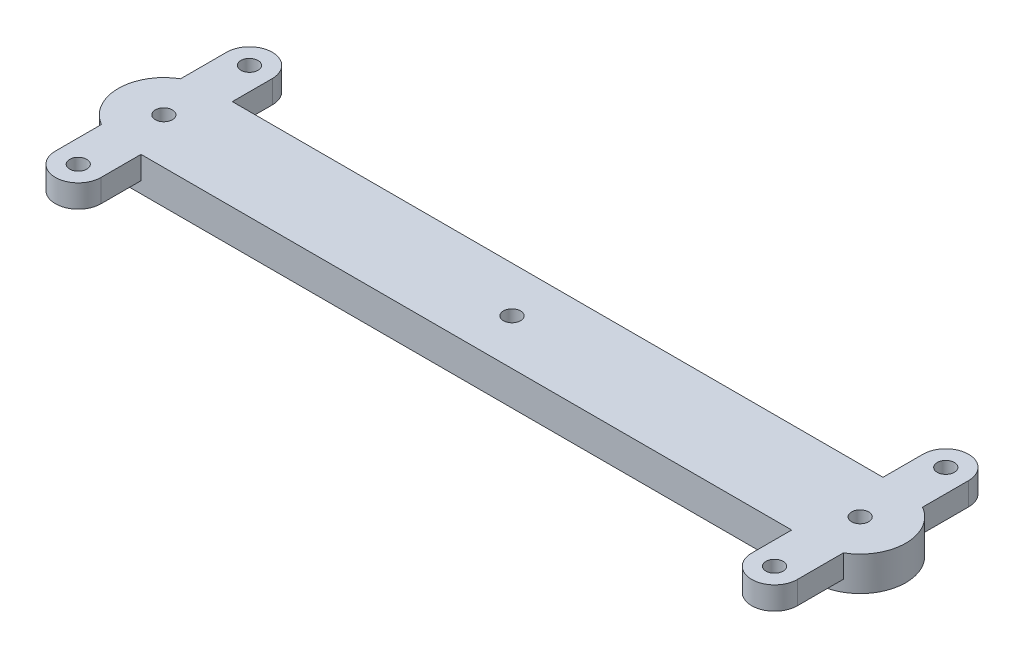
ISO-10303-21;
HEADER;
FILE_DESCRIPTION(('STEP AP214'),'2;1');
FILE_NAME('part.step','',(''),(''),'','','');
FILE_SCHEMA(('AUTOMOTIVE_DESIGN { 1 0 10303 214 1 1 1 1 }'));
ENDSEC;
DATA;
#1=APPLICATION_CONTEXT('core data for automotive mechanical design processes');
#2=APPLICATION_PROTOCOL_DEFINITION('international standard','automotive_design',2000,#1);
#3=PRODUCT_CONTEXT('',#1,'mechanical');
#4=PRODUCT('Part','Part','',(#3));
#5=PRODUCT_RELATED_PRODUCT_CATEGORY('part','',(#4));
#6=PRODUCT_DEFINITION_FORMATION('','',#4);
#7=PRODUCT_DEFINITION_CONTEXT('part definition',#1,'design');
#8=PRODUCT_DEFINITION('design','',#6,#7);
#9=PRODUCT_DEFINITION_SHAPE('','',#8);
#10=(LENGTH_UNIT() NAMED_UNIT(*) SI_UNIT(.MILLI.,.METRE.));
#11=(NAMED_UNIT(*) PLANE_ANGLE_UNIT() SI_UNIT($,.RADIAN.));
#12=(NAMED_UNIT(*) SI_UNIT($,.STERADIAN.) SOLID_ANGLE_UNIT());
#13=UNCERTAINTY_MEASURE_WITH_UNIT(LENGTH_MEASURE(1.E-05),#10,'distance_accuracy_value','');
#14=(GEOMETRIC_REPRESENTATION_CONTEXT(3) GLOBAL_UNCERTAINTY_ASSIGNED_CONTEXT((#13)) GLOBAL_UNIT_ASSIGNED_CONTEXT((#10,
#11,#12)) REPRESENTATION_CONTEXT('',''));
#15=CARTESIAN_POINT('',(0.,0.,0.));
#16=DIRECTION('',(0.,0.,1.));
#17=DIRECTION('',(1.,0.,0.));
#18=AXIS2_PLACEMENT_3D('',#15,#16,#17);
#19=CARTESIAN_POINT('',(0.,6.,8.));
#20=DIRECTION('',(0.,0.,-1.));
#21=DIRECTION('',(-1.,0.,0.));
#22=AXIS2_PLACEMENT_3D('',#19,#20,#21);
#23=PLANE('',#22);
#24=DIRECTION('',(0.,1.,0.));
#25=VECTOR('',#24,1.);
#26=CARTESIAN_POINT('',(4.,6.,8.));
#27=LINE('',#26,#25);
#28=CARTESIAN_POINT('',(4.,2.,8.));
#29=VERTEX_POINT('',#28);
#30=CARTESIAN_POINT('',(4.,6.,8.));
#31=VERTEX_POINT('',#30);
#32=EDGE_CURVE('E334',#29,#31,#27,.T.);
#33=ORIENTED_EDGE('',*,*,#32,.F.);
#34=DIRECTION('',(1.,0.,0.));
#35=VECTOR('',#34,1.);
#36=CARTESIAN_POINT('',(0.,2.,8.));
#37=LINE('',#36,#35);
#38=CARTESIAN_POINT('',(0.,2.,8.));
#39=VERTEX_POINT('',#38);
#40=EDGE_CURVE('E330',#39,#29,#37,.T.);
#41=ORIENTED_EDGE('',*,*,#40,.F.);
#42=DIRECTION('',(0.,-1.,0.));
#43=VECTOR('',#42,1.);
#44=CARTESIAN_POINT('',(0.,6.,8.));
#45=LINE('',#44,#43);
#46=CARTESIAN_POINT('',(0.,0.,8.));
#47=VERTEX_POINT('',#46);
#48=EDGE_CURVE('E492',#39,#47,#45,.T.);
#49=ORIENTED_EDGE('',*,*,#48,.T.);
#50=DIRECTION('',(1.,0.,0.));
#51=VECTOR('',#50,1.);
#52=CARTESIAN_POINT('',(0.,0.,8.));
#53=LINE('',#52,#51);
#54=CARTESIAN_POINT('',(122.,0.,8.));
#55=VERTEX_POINT('',#54);
#56=EDGE_CURVE('E473',#47,#55,#53,.T.);
#57=ORIENTED_EDGE('',*,*,#56,.T.);
#58=DIRECTION('',(0.,-1.,0.));
#59=VECTOR('',#58,1.);
#60=CARTESIAN_POINT('',(122.,6.,8.));
#61=LINE('',#60,#59);
#62=CARTESIAN_POINT('',(122.,2.,8.));
#63=VERTEX_POINT('',#62);
#64=EDGE_CURVE('E489',#63,#55,#61,.T.);
#65=ORIENTED_EDGE('',*,*,#64,.F.);
#66=DIRECTION('',(1.,0.,0.));
#67=VECTOR('',#66,1.);
#68=CARTESIAN_POINT('',(0.,2.,8.));
#69=LINE('',#68,#67);
#70=CARTESIAN_POINT('',(118.,2.,8.));
#71=VERTEX_POINT('',#70);
#72=EDGE_CURVE('E373',#71,#63,#69,.T.);
#73=ORIENTED_EDGE('',*,*,#72,.F.);
#74=DIRECTION('',(0.,1.,0.));
#75=VECTOR('',#74,1.);
#76=CARTESIAN_POINT('',(118.,2.,8.));
#77=LINE('',#76,#75);
#78=CARTESIAN_POINT('',(118.,6.,8.));
#79=VERTEX_POINT('',#78);
#80=EDGE_CURVE('E347',#71,#79,#77,.T.);
#81=ORIENTED_EDGE('',*,*,#80,.T.);
#82=DIRECTION('',(1.,0.,0.));
#83=VECTOR('',#82,1.);
#84=CARTESIAN_POINT('',(0.,6.,8.));
#85=LINE('',#84,#83);
#86=EDGE_CURVE('E460',#31,#79,#85,.T.);
#87=ORIENTED_EDGE('',*,*,#86,.F.);
#88=EDGE_LOOP('',(#33,#41,#49,#57,#65,#73,#81,#87));
#89=FACE_BOUND('',#88,.T.);
#90=ADVANCED_FACE('F119',(#89),#23,.F.);
#91=CARTESIAN_POINT('',(0.,6.,-8.));
#92=DIRECTION('',(0.,0.,-1.));
#93=DIRECTION('',(-1.,0.,0.));
#94=AXIS2_PLACEMENT_3D('',#91,#92,#93);
#95=PLANE('',#94);
#96=DIRECTION('',(1.,0.,0.));
#97=VECTOR('',#96,1.);
#98=CARTESIAN_POINT('',(0.,2.,-8.));
#99=LINE('',#98,#97);
#100=CARTESIAN_POINT('',(0.,2.,-8.));
#101=VERTEX_POINT('',#100);
#102=CARTESIAN_POINT('',(4.,2.,-8.));
#103=VERTEX_POINT('',#102);
#104=EDGE_CURVE('E321',#101,#103,#99,.T.);
#105=ORIENTED_EDGE('',*,*,#104,.T.);
#106=DIRECTION('',(0.,1.,0.));
#107=VECTOR('',#106,1.);
#108=CARTESIAN_POINT('',(4.,6.,-8.));
#109=LINE('',#108,#107);
#110=CARTESIAN_POINT('',(4.,6.,-8.));
#111=VERTEX_POINT('',#110);
#112=EDGE_CURVE('E495',#103,#111,#109,.T.);
#113=ORIENTED_EDGE('',*,*,#112,.T.);
#114=DIRECTION('',(1.,0.,0.));
#115=VECTOR('',#114,1.);
#116=CARTESIAN_POINT('',(0.,6.,-8.));
#117=LINE('',#116,#115);
#118=CARTESIAN_POINT('',(118.,6.,-8.));
#119=VERTEX_POINT('',#118);
#120=EDGE_CURVE('E276',#111,#119,#117,.T.);
#121=ORIENTED_EDGE('',*,*,#120,.T.);
#122=DIRECTION('',(0.,1.,0.));
#123=VECTOR('',#122,1.);
#124=CARTESIAN_POINT('',(118.,2.,-8.));
#125=LINE('',#124,#123);
#126=CARTESIAN_POINT('',(118.,2.,-8.));
#127=VERTEX_POINT('',#126);
#128=EDGE_CURVE('E436',#127,#119,#125,.T.);
#129=ORIENTED_EDGE('',*,*,#128,.F.);
#130=DIRECTION('',(-1.,0.,0.));
#131=VECTOR('',#130,1.);
#132=CARTESIAN_POINT('',(0.,2.,-8.));
#133=LINE('',#132,#131);
#134=CARTESIAN_POINT('',(122.,2.,-8.));
#135=VERTEX_POINT('',#134);
#136=EDGE_CURVE('E401',#135,#127,#133,.T.);
#137=ORIENTED_EDGE('',*,*,#136,.F.);
#138=DIRECTION('',(0.,-1.,0.));
#139=VECTOR('',#138,1.);
#140=CARTESIAN_POINT('',(122.,6.,-8.));
#141=LINE('',#140,#139);
#142=CARTESIAN_POINT('',(122.,0.,-8.));
#143=VERTEX_POINT('',#142);
#144=EDGE_CURVE('E486',#135,#143,#141,.T.);
#145=ORIENTED_EDGE('',*,*,#144,.T.);
#146=DIRECTION('',(1.,0.,0.));
#147=VECTOR('',#146,1.);
#148=CARTESIAN_POINT('',(0.,0.,-8.));
#149=LINE('',#148,#147);
#150=CARTESIAN_POINT('',(0.,0.,-8.));
#151=VERTEX_POINT('',#150);
#152=EDGE_CURVE('E461',#151,#143,#149,.T.);
#153=ORIENTED_EDGE('',*,*,#152,.F.);
#154=DIRECTION('',(0.,-1.,0.));
#155=VECTOR('',#154,1.);
#156=CARTESIAN_POINT('',(0.,6.,-8.));
#157=LINE('',#156,#155);
#158=EDGE_CURVE('E469',#101,#151,#157,.T.);
#159=ORIENTED_EDGE('',*,*,#158,.F.);
#160=EDGE_LOOP('',(#105,#113,#121,#129,#137,#145,#153,#159));
#161=FACE_BOUND('',#160,.T.);
#162=ADVANCED_FACE('F515',(#161),#95,.T.);
#163=CARTESIAN_POINT('',(122.,6.,0.));
#164=DIRECTION('',(0.,-1.,0.));
#165=DIRECTION('',(0.,0.,-1.));
#166=AXIS2_PLACEMENT_3D('',#163,#164,#165);
#167=CYLINDRICAL_SURFACE('',#166,8.);
#168=DIRECTION('',(0.,1.,0.));
#169=VECTOR('',#168,1.);
#170=CARTESIAN_POINT('',(126.,2.,6.92820323027551));
#171=LINE('',#170,#169);
#172=CARTESIAN_POINT('',(126.,2.,6.92820323027551));
#173=VERTEX_POINT('',#172);
#174=CARTESIAN_POINT('',(126.,6.,6.92820323027551));
#175=VERTEX_POINT('',#174);
#176=EDGE_CURVE('E344',#173,#175,#171,.T.);
#177=ORIENTED_EDGE('',*,*,#176,.F.);
#178=CARTESIAN_POINT('',(122.,2.,0.));
#179=DIRECTION('',(0.,1.,0.));
#180=DIRECTION('',(0.,0.,1.));
#181=AXIS2_PLACEMENT_3D('',#178,#179,#180);
#182=CIRCLE('',#181,8.);
#183=EDGE_CURVE('E376',#63,#173,#182,.T.);
#184=ORIENTED_EDGE('',*,*,#183,.F.);
#185=ORIENTED_EDGE('',*,*,#64,.T.);
#186=CARTESIAN_POINT('',(122.,0.,0.));
#187=DIRECTION('',(0.,1.,0.));
#188=DIRECTION('',(0.,0.,1.));
#189=AXIS2_PLACEMENT_3D('',#186,#187,#188);
#190=CIRCLE('',#189,8.);
#191=EDGE_CURVE('E477',#55,#143,#190,.T.);
#192=ORIENTED_EDGE('',*,*,#191,.T.);
#193=ORIENTED_EDGE('',*,*,#144,.F.);
#194=CARTESIAN_POINT('',(122.,2.,0.));
#195=DIRECTION('',(0.,1.,0.));
#196=DIRECTION('',(0.,0.,1.));
#197=AXIS2_PLACEMENT_3D('',#194,#195,#196);
#198=CIRCLE('',#197,8.);
#199=CARTESIAN_POINT('',(126.,2.,-6.92820323027551));
#200=VERTEX_POINT('',#199);
#201=EDGE_CURVE('E405',#200,#135,#198,.T.);
#202=ORIENTED_EDGE('',*,*,#201,.F.);
#203=DIRECTION('',(0.,1.,0.));
#204=VECTOR('',#203,1.);
#205=CARTESIAN_POINT('',(126.,2.,-6.92820323027551));
#206=LINE('',#205,#204);
#207=CARTESIAN_POINT('',(126.,6.,-6.92820323027551));
#208=VERTEX_POINT('',#207);
#209=EDGE_CURVE('E432',#200,#208,#206,.T.);
#210=ORIENTED_EDGE('',*,*,#209,.T.);
#211=CARTESIAN_POINT('',(122.,6.,0.));
#212=DIRECTION('',(0.,1.,0.));
#213=DIRECTION('',(0.,0.,1.));
#214=AXIS2_PLACEMENT_3D('',#211,#212,#213);
#215=CIRCLE('',#214,8.);
#216=EDGE_CURVE('E464',#175,#208,#215,.T.);
#217=ORIENTED_EDGE('',*,*,#216,.F.);
#218=EDGE_LOOP('',(#177,#184,#185,#192,#193,#202,#210,#217));
#219=FACE_BOUND('',#218,.T.);
#220=ADVANCED_FACE('F568',(#219),#167,.T.);
#221=CARTESIAN_POINT('',(0.,6.,0.));
#222=DIRECTION('',(0.,1.,0.));
#223=DIRECTION('',(0.,0.,1.));
#224=AXIS2_PLACEMENT_3D('',#221,#222,#223);
#225=PLANE('',#224);
#226=CARTESIAN_POINT('',(61.,6.,0.));
#227=DIRECTION('',(0.,1.,0.));
#228=DIRECTION('',(0.,0.,1.));
#229=AXIS2_PLACEMENT_3D('',#226,#227,#228);
#230=CIRCLE('',#229,1.5);
#231=CARTESIAN_POINT('',(61.,6.,1.5));
#232=VERTEX_POINT('',#231);
#233=EDGE_CURVE('E542',#232,#232,#230,.T.);
#234=ORIENTED_EDGE('',*,*,#233,.F.);
#235=EDGE_LOOP('',(#234));
#236=FACE_BOUND('',#235,.T.);
#237=CARTESIAN_POINT('',(0.,6.,0.));
#238=DIRECTION('',(0.,1.,0.));
#239=DIRECTION('',(0.,0.,1.));
#240=AXIS2_PLACEMENT_3D('',#237,#238,#239);
#241=CIRCLE('',#240,8.);
#242=CARTESIAN_POINT('',(-4.,6.,-6.92820323027551));
#243=VERTEX_POINT('',#242);
#244=CARTESIAN_POINT('',(-4.,6.,6.92820323027551));
#245=VERTEX_POINT('',#244);
#246=EDGE_CURVE('E139',#243,#245,#241,.T.);
#247=ORIENTED_EDGE('',*,*,#246,.T.);
#248=DIRECTION('',(0.,0.,1.));
#249=VECTOR('',#248,1.);
#250=CARTESIAN_POINT('',(-4.,6.,-15.));
#251=LINE('',#250,#249);
#252=CARTESIAN_POINT('',(-4.,6.,15.));
#253=VERTEX_POINT('',#252);
#254=EDGE_CURVE('E294',#245,#253,#251,.T.);
#255=ORIENTED_EDGE('',*,*,#254,.T.);
#256=CARTESIAN_POINT('',(0.,6.,15.));
#257=DIRECTION('',(0.,1.,0.));
#258=DIRECTION('',(0.,0.,1.));
#259=AXIS2_PLACEMENT_3D('',#256,#257,#258);
#260=CIRCLE('',#259,4.);
#261=CARTESIAN_POINT('',(4.,6.,15.));
#262=VERTEX_POINT('',#261);
#263=EDGE_CURVE('E279',#253,#262,#260,.T.);
#264=ORIENTED_EDGE('',*,*,#263,.T.);
#265=DIRECTION('',(0.,0.,1.));
#266=VECTOR('',#265,1.);
#267=CARTESIAN_POINT('',(4.,6.,-15.));
#268=LINE('',#267,#266);
#269=EDGE_CURVE('E280',#31,#262,#268,.T.);
#270=ORIENTED_EDGE('',*,*,#269,.F.);
#271=ORIENTED_EDGE('',*,*,#86,.T.);
#272=DIRECTION('',(0.,0.,1.));
#273=VECTOR('',#272,1.);
#274=CARTESIAN_POINT('',(118.,6.,0.));
#275=LINE('',#274,#273);
#276=CARTESIAN_POINT('',(118.,6.,15.));
#277=VERTEX_POINT('',#276);
#278=EDGE_CURVE('E353',#79,#277,#275,.T.);
#279=ORIENTED_EDGE('',*,*,#278,.T.);
#280=CARTESIAN_POINT('',(122.,6.,15.));
#281=DIRECTION('',(0.,1.,0.));
#282=DIRECTION('',(0.,0.,1.));
#283=AXIS2_PLACEMENT_3D('',#280,#281,#282);
#284=CIRCLE('',#283,4.);
#285=CARTESIAN_POINT('',(126.,6.,15.));
#286=VERTEX_POINT('',#285);
#287=EDGE_CURVE('E361',#286,#277,#284,.F.);
#288=ORIENTED_EDGE('',*,*,#287,.F.);
#289=DIRECTION('',(0.,0.,1.));
#290=VECTOR('',#289,1.);
#291=CARTESIAN_POINT('',(126.,6.,0.));
#292=LINE('',#291,#290);
#293=EDGE_CURVE('E357',#175,#286,#292,.T.);
#294=ORIENTED_EDGE('',*,*,#293,.F.);
#295=ORIENTED_EDGE('',*,*,#216,.T.);
#296=DIRECTION('',(0.,0.,1.));
#297=VECTOR('',#296,1.);
#298=CARTESIAN_POINT('',(126.,6.,0.));
#299=LINE('',#298,#297);
#300=CARTESIAN_POINT('',(126.,6.,-15.));
#301=VERTEX_POINT('',#300);
#302=EDGE_CURVE('E393',#301,#208,#299,.T.);
#303=ORIENTED_EDGE('',*,*,#302,.F.);
#304=CARTESIAN_POINT('',(122.,6.,-15.));
#305=DIRECTION('',(0.,1.,0.));
#306=DIRECTION('',(0.,0.,1.));
#307=AXIS2_PLACEMENT_3D('',#304,#305,#306);
#308=CIRCLE('',#307,3.99999999999999);
#309=CARTESIAN_POINT('',(118.,6.,-15.));
#310=VERTEX_POINT('',#309);
#311=EDGE_CURVE('E417',#310,#301,#308,.F.);
#312=ORIENTED_EDGE('',*,*,#311,.F.);
#313=DIRECTION('',(0.,0.,1.));
#314=VECTOR('',#313,1.);
#315=CARTESIAN_POINT('',(118.,6.,0.));
#316=LINE('',#315,#314);
#317=EDGE_CURVE('E421',#310,#119,#316,.T.);
#318=ORIENTED_EDGE('',*,*,#317,.T.);
#319=ORIENTED_EDGE('',*,*,#120,.F.);
#320=CARTESIAN_POINT('',(4.,6.,-15.));
#321=VERTEX_POINT('',#320);
#322=EDGE_CURVE('E259',#321,#111,#268,.T.);
#323=ORIENTED_EDGE('',*,*,#322,.F.);
#324=CARTESIAN_POINT('',(0.,6.,-15.));
#325=DIRECTION('',(0.,1.,0.));
#326=DIRECTION('',(0.,0.,1.));
#327=AXIS2_PLACEMENT_3D('',#324,#325,#326);
#328=CIRCLE('',#327,4.);
#329=CARTESIAN_POINT('',(-4.,6.,-15.));
#330=VERTEX_POINT('',#329);
#331=EDGE_CURVE('E274',#321,#330,#328,.T.);
#332=ORIENTED_EDGE('',*,*,#331,.T.);
#333=EDGE_CURVE('E287',#330,#243,#251,.T.);
#334=ORIENTED_EDGE('',*,*,#333,.T.);
#335=EDGE_LOOP('',(#247,#255,#264,#270,#271,#279,#288,#294,#295,#303,#312,#318,#319,#323,#332,#334));
#336=FACE_BOUND('',#335,.T.);
#337=CARTESIAN_POINT('',(0.,6.,0.));
#338=DIRECTION('',(0.,1.,0.));
#339=DIRECTION('',(0.,0.,1.));
#340=AXIS2_PLACEMENT_3D('',#337,#338,#339);
#341=CIRCLE('',#340,1.5);
#342=CARTESIAN_POINT('',(0.,6.,1.5));
#343=VERTEX_POINT('',#342);
#344=EDGE_CURVE('E442',#343,#343,#341,.T.);
#345=ORIENTED_EDGE('',*,*,#344,.F.);
#346=EDGE_LOOP('',(#345));
#347=FACE_BOUND('',#346,.T.);
#348=CARTESIAN_POINT('',(0.,6.,-15.));
#349=DIRECTION('',(0.,1.,0.));
#350=DIRECTION('',(0.,0.,1.));
#351=AXIS2_PLACEMENT_3D('',#348,#349,#350);
#352=CIRCLE('',#351,1.5);
#353=CARTESIAN_POINT('',(0.,6.,-13.5));
#354=VERTEX_POINT('',#353);
#355=EDGE_CURVE('E317',#354,#354,#352,.T.);
#356=ORIENTED_EDGE('',*,*,#355,.F.);
#357=EDGE_LOOP('',(#356));
#358=FACE_BOUND('',#357,.T.);
#359=CARTESIAN_POINT('',(0.,6.,15.));
#360=DIRECTION('',(0.,1.,0.));
#361=DIRECTION('',(0.,0.,1.));
#362=AXIS2_PLACEMENT_3D('',#359,#360,#361);
#363=CIRCLE('',#362,1.5);
#364=CARTESIAN_POINT('',(0.,6.,16.5));
#365=VERTEX_POINT('',#364);
#366=EDGE_CURVE('E292',#365,#365,#363,.T.);
#367=ORIENTED_EDGE('',*,*,#366,.F.);
#368=EDGE_LOOP('',(#367));
#369=FACE_BOUND('',#368,.T.);
#370=CARTESIAN_POINT('',(122.,6.,15.));
#371=DIRECTION('',(0.,1.,0.));
#372=DIRECTION('',(0.,0.,1.));
#373=AXIS2_PLACEMENT_3D('',#370,#371,#372);
#374=CIRCLE('',#373,1.5);
#375=CARTESIAN_POINT('',(122.,6.,16.5));
#376=VERTEX_POINT('',#375);
#377=EDGE_CURVE('E365',#376,#376,#374,.T.);
#378=ORIENTED_EDGE('',*,*,#377,.F.);
#379=EDGE_LOOP('',(#378));
#380=FACE_BOUND('',#379,.T.);
#381=CARTESIAN_POINT('',(122.,6.,-15.));
#382=DIRECTION('',(0.,1.,0.));
#383=DIRECTION('',(0.,0.,1.));
#384=AXIS2_PLACEMENT_3D('',#381,#382,#383);
#385=CIRCLE('',#384,1.5);
#386=CARTESIAN_POINT('',(122.,6.,-13.5));
#387=VERTEX_POINT('',#386);
#388=EDGE_CURVE('E369',#387,#387,#385,.T.);
#389=ORIENTED_EDGE('',*,*,#388,.F.);
#390=EDGE_LOOP('',(#389));
#391=FACE_BOUND('',#390,.T.);
#392=CARTESIAN_POINT('',(122.,6.,0.));
#393=DIRECTION('',(0.,1.,0.));
#394=DIRECTION('',(0.,0.,1.));
#395=AXIS2_PLACEMENT_3D('',#392,#393,#394);
#396=CIRCLE('',#395,1.5);
#397=CARTESIAN_POINT('',(122.,6.,1.5));
#398=VERTEX_POINT('',#397);
#399=EDGE_CURVE('E450',#398,#398,#396,.T.);
#400=ORIENTED_EDGE('',*,*,#399,.F.);
#401=EDGE_LOOP('',(#400));
#402=FACE_BOUND('',#401,.T.);
#403=ADVANCED_FACE('F271',(#236,#336,#347,#358,#369,#380,#391,#402),#225,.T.);
#404=CARTESIAN_POINT('',(0.,0.,0.));
#405=DIRECTION('',(0.,1.,0.));
#406=DIRECTION('',(0.,0.,1.));
#407=AXIS2_PLACEMENT_3D('',#404,#405,#406);
#408=PLANE('',#407);
#409=CARTESIAN_POINT('',(61.,0.,0.));
#410=DIRECTION('',(0.,1.,0.));
#411=DIRECTION('',(0.,0.,1.));
#412=AXIS2_PLACEMENT_3D('',#409,#410,#411);
#413=CIRCLE('',#412,1.5);
#414=CARTESIAN_POINT('',(61.,0.,1.5));
#415=VERTEX_POINT('',#414);
#416=EDGE_CURVE('E123',#415,#415,#413,.T.);
#417=ORIENTED_EDGE('',*,*,#416,.T.);
#418=EDGE_LOOP('',(#417));
#419=FACE_BOUND('',#418,.T.);
#420=CARTESIAN_POINT('',(0.,0.,0.));
#421=DIRECTION('',(0.,1.,0.));
#422=DIRECTION('',(0.,0.,1.));
#423=AXIS2_PLACEMENT_3D('',#420,#421,#422);
#424=CIRCLE('',#423,8.);
#425=EDGE_CURVE('E454',#151,#47,#424,.T.);
#426=ORIENTED_EDGE('',*,*,#425,.F.);
#427=ORIENTED_EDGE('',*,*,#152,.T.);
#428=ORIENTED_EDGE('',*,*,#191,.F.);
#429=ORIENTED_EDGE('',*,*,#56,.F.);
#430=EDGE_LOOP('',(#426,#427,#428,#429));
#431=FACE_BOUND('',#430,.T.);
#432=CARTESIAN_POINT('',(122.,0.,0.));
#433=DIRECTION('',(0.,1.,0.));
#434=DIRECTION('',(0.,0.,1.));
#435=AXIS2_PLACEMENT_3D('',#432,#433,#434);
#436=CIRCLE('',#435,1.5);
#437=CARTESIAN_POINT('',(122.,0.,1.5));
#438=VERTEX_POINT('',#437);
#439=EDGE_CURVE('E446',#438,#438,#436,.T.);
#440=ORIENTED_EDGE('',*,*,#439,.T.);
#441=EDGE_LOOP('',(#440));
#442=FACE_BOUND('',#441,.T.);
#443=CARTESIAN_POINT('',(0.,0.,0.));
#444=DIRECTION('',(0.,1.,0.));
#445=DIRECTION('',(0.,0.,1.));
#446=AXIS2_PLACEMENT_3D('',#443,#444,#445);
#447=CIRCLE('',#446,1.5);
#448=CARTESIAN_POINT('',(0.,0.,1.5));
#449=VERTEX_POINT('',#448);
#450=EDGE_CURVE('E431',#449,#449,#447,.T.);
#451=ORIENTED_EDGE('',*,*,#450,.T.);
#452=EDGE_LOOP('',(#451));
#453=FACE_BOUND('',#452,.T.);
#454=ADVANCED_FACE('F519',(#419,#431,#442,#453),#408,.F.);
#455=CARTESIAN_POINT('',(0.,6.,0.));
#456=DIRECTION('',(0.,-1.,0.));
#457=DIRECTION('',(0.,0.,-1.));
#458=AXIS2_PLACEMENT_3D('',#455,#456,#457);
#459=CYLINDRICAL_SURFACE('',#458,8.);
#460=ORIENTED_EDGE('',*,*,#246,.F.);
#461=DIRECTION('',(0.,-1.,0.));
#462=VECTOR('',#461,1.);
#463=CARTESIAN_POINT('',(-4.,6.,-6.92820323027551));
#464=LINE('',#463,#462);
#465=CARTESIAN_POINT('',(-4.,2.,-6.92820323027551));
#466=VERTEX_POINT('',#465);
#467=EDGE_CURVE('E12',#243,#466,#464,.T.);
#468=ORIENTED_EDGE('',*,*,#467,.T.);
#469=CARTESIAN_POINT('',(0.,2.,0.));
#470=DIRECTION('',(0.,1.,0.));
#471=DIRECTION('',(0.,0.,1.));
#472=AXIS2_PLACEMENT_3D('',#469,#470,#471);
#473=CIRCLE('',#472,8.);
#474=EDGE_CURVE('E327',#101,#466,#473,.T.);
#475=ORIENTED_EDGE('',*,*,#474,.F.);
#476=ORIENTED_EDGE('',*,*,#158,.T.);
#477=ORIENTED_EDGE('',*,*,#425,.T.);
#478=ORIENTED_EDGE('',*,*,#48,.F.);
#479=CARTESIAN_POINT('',(-4.,2.,6.92820323027551));
#480=VERTEX_POINT('',#479);
#481=EDGE_CURVE('E331',#480,#39,#473,.T.);
#482=ORIENTED_EDGE('',*,*,#481,.F.);
#483=DIRECTION('',(0.,-1.,0.));
#484=VECTOR('',#483,1.);
#485=CARTESIAN_POINT('',(-4.,6.,6.92820323027551));
#486=LINE('',#485,#484);
#487=EDGE_CURVE('E129',#480,#245,#486,.F.);
#488=ORIENTED_EDGE('',*,*,#487,.T.);
#489=EDGE_LOOP('',(#460,#468,#475,#476,#477,#478,#482,#488));
#490=FACE_BOUND('',#489,.T.);
#491=ADVANCED_FACE('F121',(#490),#459,.T.);
#492=CARTESIAN_POINT('',(122.,6.,0.));
#493=DIRECTION('',(0.,-1.,0.));
#494=DIRECTION('',(0.,0.,-1.));
#495=AXIS2_PLACEMENT_3D('',#492,#493,#494);
#496=CYLINDRICAL_SURFACE('',#495,1.5);
#497=ORIENTED_EDGE('',*,*,#399,.T.);
#498=EDGE_LOOP('',(#497));
#499=FACE_BOUND('',#498,.T.);
#500=ORIENTED_EDGE('',*,*,#439,.F.);
#501=EDGE_LOOP('',(#500));
#502=FACE_BOUND('',#501,.T.);
#503=ADVANCED_FACE('F580',(#499,#502),#496,.F.);
#504=CARTESIAN_POINT('',(0.,6.,0.));
#505=DIRECTION('',(0.,-1.,0.));
#506=DIRECTION('',(0.,0.,-1.));
#507=AXIS2_PLACEMENT_3D('',#504,#505,#506);
#508=CYLINDRICAL_SURFACE('',#507,1.5);
#509=ORIENTED_EDGE('',*,*,#344,.T.);
#510=EDGE_LOOP('',(#509));
#511=FACE_BOUND('',#510,.T.);
#512=ORIENTED_EDGE('',*,*,#450,.F.);
#513=EDGE_LOOP('',(#512));
#514=FACE_BOUND('',#513,.T.);
#515=ADVANCED_FACE('F583',(#511,#514),#508,.F.);
#516=CARTESIAN_POINT('',(122.,2.,-15.));
#517=DIRECTION('',(0.,1.,0.));
#518=DIRECTION('',(0.,0.,1.));
#519=AXIS2_PLACEMENT_3D('',#516,#517,#518);
#520=CYLINDRICAL_SURFACE('',#519,3.99999999999999);
#521=ORIENTED_EDGE('',*,*,#311,.T.);
#522=DIRECTION('',(0.,1.,0.));
#523=VECTOR('',#522,1.);
#524=CARTESIAN_POINT('',(126.,2.,-15.));
#525=LINE('',#524,#523);
#526=CARTESIAN_POINT('',(126.,2.,-15.));
#527=VERTEX_POINT('',#526);
#528=EDGE_CURVE('E427',#527,#301,#525,.T.);
#529=ORIENTED_EDGE('',*,*,#528,.F.);
#530=CARTESIAN_POINT('',(122.,2.,-15.));
#531=DIRECTION('',(0.,1.,0.));
#532=DIRECTION('',(0.,0.,1.));
#533=AXIS2_PLACEMENT_3D('',#530,#531,#532);
#534=CIRCLE('',#533,3.99999999999999);
#535=CARTESIAN_POINT('',(118.,2.,-15.));
#536=VERTEX_POINT('',#535);
#537=EDGE_CURVE('E392',#536,#527,#534,.F.);
#538=ORIENTED_EDGE('',*,*,#537,.F.);
#539=DIRECTION('',(0.,1.,0.));
#540=VECTOR('',#539,1.);
#541=CARTESIAN_POINT('',(118.,2.,-15.));
#542=LINE('',#541,#540);
#543=EDGE_CURVE('E413',#536,#310,#542,.T.);
#544=ORIENTED_EDGE('',*,*,#543,.T.);
#545=EDGE_LOOP('',(#521,#529,#538,#544));
#546=FACE_BOUND('',#545,.T.);
#547=ADVANCED_FACE('F587',(#546),#520,.T.);
#548=CARTESIAN_POINT('',(126.,2.,0.));
#549=DIRECTION('',(-1.,0.,0.));
#550=DIRECTION('',(0.,0.,1.));
#551=AXIS2_PLACEMENT_3D('',#548,#549,#550);
#552=PLANE('',#551);
#553=ORIENTED_EDGE('',*,*,#302,.T.);
#554=ORIENTED_EDGE('',*,*,#209,.F.);
#555=DIRECTION('',(0.,0.,1.));
#556=VECTOR('',#555,1.);
#557=CARTESIAN_POINT('',(126.,2.,0.));
#558=LINE('',#557,#556);
#559=EDGE_CURVE('E409',#527,#200,#558,.T.);
#560=ORIENTED_EDGE('',*,*,#559,.F.);
#561=ORIENTED_EDGE('',*,*,#528,.T.);
#562=EDGE_LOOP('',(#553,#554,#560,#561));
#563=FACE_BOUND('',#562,.T.);
#564=ADVANCED_FACE('F593',(#563),#552,.F.);
#565=CARTESIAN_POINT('',(122.,2.,-15.));
#566=DIRECTION('',(0.,1.,0.));
#567=DIRECTION('',(0.,0.,1.));
#568=AXIS2_PLACEMENT_3D('',#565,#566,#567);
#569=CYLINDRICAL_SURFACE('',#568,1.5);
#570=CARTESIAN_POINT('',(122.,2.,-15.));
#571=DIRECTION('',(0.,1.,0.));
#572=DIRECTION('',(0.,0.,1.));
#573=AXIS2_PLACEMENT_3D('',#570,#571,#572);
#574=CIRCLE('',#573,1.5);
#575=CARTESIAN_POINT('',(122.,2.,-13.5));
#576=VERTEX_POINT('',#575);
#577=EDGE_CURVE('E388',#576,#576,#574,.T.);
#578=ORIENTED_EDGE('',*,*,#577,.F.);
#579=EDGE_LOOP('',(#578));
#580=FACE_BOUND('',#579,.T.);
#581=ORIENTED_EDGE('',*,*,#388,.T.);
#582=EDGE_LOOP('',(#581));
#583=FACE_BOUND('',#582,.T.);
#584=ADVANCED_FACE('F589',(#580,#583),#569,.F.);
#585=CARTESIAN_POINT('',(118.,2.,0.));
#586=DIRECTION('',(-1.,0.,0.));
#587=DIRECTION('',(0.,0.,1.));
#588=AXIS2_PLACEMENT_3D('',#585,#586,#587);
#589=PLANE('',#588);
#590=ORIENTED_EDGE('',*,*,#317,.F.);
#591=ORIENTED_EDGE('',*,*,#543,.F.);
#592=DIRECTION('',(0.,0.,1.));
#593=VECTOR('',#592,1.);
#594=CARTESIAN_POINT('',(118.,2.,0.));
#595=LINE('',#594,#593);
#596=EDGE_CURVE('E397',#536,#127,#595,.T.);
#597=ORIENTED_EDGE('',*,*,#596,.T.);
#598=ORIENTED_EDGE('',*,*,#128,.T.);
#599=EDGE_LOOP('',(#590,#591,#597,#598));
#600=FACE_BOUND('',#599,.T.);
#601=ADVANCED_FACE('F592',(#600),#589,.T.);
#602=CARTESIAN_POINT('',(0.,2.,0.));
#603=DIRECTION('',(0.,1.,0.));
#604=DIRECTION('',(0.,0.,1.));
#605=AXIS2_PLACEMENT_3D('',#602,#603,#604);
#606=PLANE('',#605);
#607=ORIENTED_EDGE('',*,*,#577,.T.);
#608=EDGE_LOOP('',(#607));
#609=FACE_BOUND('',#608,.T.);
#610=ORIENTED_EDGE('',*,*,#537,.T.);
#611=ORIENTED_EDGE('',*,*,#559,.T.);
#612=ORIENTED_EDGE('',*,*,#201,.T.);
#613=ORIENTED_EDGE('',*,*,#136,.T.);
#614=ORIENTED_EDGE('',*,*,#596,.F.);
#615=EDGE_LOOP('',(#610,#611,#612,#613,#614));
#616=FACE_BOUND('',#615,.T.);
#617=ADVANCED_FACE('F600',(#609,#616),#606,.F.);
#618=CARTESIAN_POINT('',(122.,2.,15.));
#619=DIRECTION('',(0.,1.,0.));
#620=DIRECTION('',(0.,0.,1.));
#621=AXIS2_PLACEMENT_3D('',#618,#619,#620);
#622=CYLINDRICAL_SURFACE('',#621,4.);
#623=ORIENTED_EDGE('',*,*,#287,.T.);
#624=DIRECTION('',(0.,1.,0.));
#625=VECTOR('',#624,1.);
#626=CARTESIAN_POINT('',(118.,2.,15.));
#627=LINE('',#626,#625);
#628=CARTESIAN_POINT('',(118.,2.,15.));
#629=VERTEX_POINT('',#628);
#630=EDGE_CURVE('E338',#629,#277,#627,.T.);
#631=ORIENTED_EDGE('',*,*,#630,.F.);
#632=CARTESIAN_POINT('',(122.,2.,15.));
#633=DIRECTION('',(0.,1.,0.));
#634=DIRECTION('',(0.,0.,1.));
#635=AXIS2_PLACEMENT_3D('',#632,#633,#634);
#636=CIRCLE('',#635,4.);
#637=CARTESIAN_POINT('',(126.,2.,15.));
#638=VERTEX_POINT('',#637);
#639=EDGE_CURVE('E382',#638,#629,#636,.F.);
#640=ORIENTED_EDGE('',*,*,#639,.F.);
#641=DIRECTION('',(0.,1.,0.));
#642=VECTOR('',#641,1.);
#643=CARTESIAN_POINT('',(126.,2.,15.));
#644=LINE('',#643,#642);
#645=EDGE_CURVE('E339',#638,#286,#644,.T.);
#646=ORIENTED_EDGE('',*,*,#645,.T.);
#647=EDGE_LOOP('',(#623,#631,#640,#646));
#648=FACE_BOUND('',#647,.T.);
#649=ADVANCED_FACE('F607',(#648),#622,.T.);
#650=CARTESIAN_POINT('',(118.,2.,0.));
#651=DIRECTION('',(-1.,0.,0.));
#652=DIRECTION('',(0.,0.,1.));
#653=AXIS2_PLACEMENT_3D('',#650,#651,#652);
#654=PLANE('',#653);
#655=ORIENTED_EDGE('',*,*,#278,.F.);
#656=ORIENTED_EDGE('',*,*,#80,.F.);
#657=DIRECTION('',(0.,0.,1.));
#658=VECTOR('',#657,1.);
#659=CARTESIAN_POINT('',(118.,2.,0.));
#660=LINE('',#659,#658);
#661=EDGE_CURVE('E343',#71,#629,#660,.T.);
#662=ORIENTED_EDGE('',*,*,#661,.T.);
#663=ORIENTED_EDGE('',*,*,#630,.T.);
#664=EDGE_LOOP('',(#655,#656,#662,#663));
#665=FACE_BOUND('',#664,.T.);
#666=ADVANCED_FACE('F614',(#665),#654,.T.);
#667=CARTESIAN_POINT('',(122.,2.,15.));
#668=DIRECTION('',(0.,1.,0.));
#669=DIRECTION('',(0.,0.,1.));
#670=AXIS2_PLACEMENT_3D('',#667,#668,#669);
#671=CYLINDRICAL_SURFACE('',#670,1.5);
#672=CARTESIAN_POINT('',(122.,2.,15.));
#673=DIRECTION('',(0.,1.,0.));
#674=DIRECTION('',(0.,0.,1.));
#675=AXIS2_PLACEMENT_3D('',#672,#673,#674);
#676=CIRCLE('',#675,1.5);
#677=CARTESIAN_POINT('',(122.,2.,16.5));
#678=VERTEX_POINT('',#677);
#679=EDGE_CURVE('E358',#678,#678,#676,.T.);
#680=ORIENTED_EDGE('',*,*,#679,.F.);
#681=EDGE_LOOP('',(#680));
#682=FACE_BOUND('',#681,.T.);
#683=ORIENTED_EDGE('',*,*,#377,.T.);
#684=EDGE_LOOP('',(#683));
#685=FACE_BOUND('',#684,.T.);
#686=ADVANCED_FACE('F617',(#682,#685),#671,.F.);
#687=CARTESIAN_POINT('',(126.,2.,0.));
#688=DIRECTION('',(-1.,0.,0.));
#689=DIRECTION('',(0.,0.,1.));
#690=AXIS2_PLACEMENT_3D('',#687,#688,#689);
#691=PLANE('',#690);
#692=ORIENTED_EDGE('',*,*,#293,.T.);
#693=ORIENTED_EDGE('',*,*,#645,.F.);
#694=DIRECTION('',(0.,0.,1.));
#695=VECTOR('',#694,1.);
#696=CARTESIAN_POINT('',(126.,2.,0.));
#697=LINE('',#696,#695);
#698=EDGE_CURVE('E379',#173,#638,#697,.T.);
#699=ORIENTED_EDGE('',*,*,#698,.F.);
#700=ORIENTED_EDGE('',*,*,#176,.T.);
#701=EDGE_LOOP('',(#692,#693,#699,#700));
#702=FACE_BOUND('',#701,.T.);
#703=ADVANCED_FACE('F612',(#702),#691,.F.);
#704=CARTESIAN_POINT('',(0.,2.,0.));
#705=DIRECTION('',(0.,1.,0.));
#706=DIRECTION('',(0.,0.,1.));
#707=AXIS2_PLACEMENT_3D('',#704,#705,#706);
#708=PLANE('',#707);
#709=ORIENTED_EDGE('',*,*,#679,.T.);
#710=EDGE_LOOP('',(#709));
#711=FACE_BOUND('',#710,.T.);
#712=ORIENTED_EDGE('',*,*,#639,.T.);
#713=ORIENTED_EDGE('',*,*,#661,.F.);
#714=ORIENTED_EDGE('',*,*,#72,.T.);
#715=ORIENTED_EDGE('',*,*,#183,.T.);
#716=ORIENTED_EDGE('',*,*,#698,.T.);
#717=EDGE_LOOP('',(#712,#713,#714,#715,#716));
#718=FACE_BOUND('',#717,.T.);
#719=ADVANCED_FACE('F609',(#711,#718),#708,.F.);
#720=CARTESIAN_POINT('',(0.,2.,-15.));
#721=DIRECTION('',(0.,1.,0.));
#722=DIRECTION('',(0.,0.,1.));
#723=AXIS2_PLACEMENT_3D('',#720,#721,#722);
#724=CYLINDRICAL_SURFACE('',#723,4.);
#725=ORIENTED_EDGE('',*,*,#331,.F.);
#726=DIRECTION('',(0.,1.,0.));
#727=VECTOR('',#726,1.);
#728=CARTESIAN_POINT('',(4.,2.,-15.));
#729=LINE('',#728,#727);
#730=CARTESIAN_POINT('',(4.,2.,-15.));
#731=VERTEX_POINT('',#730);
#732=EDGE_CURVE('E255',#731,#321,#729,.T.);
#733=ORIENTED_EDGE('',*,*,#732,.F.);
#734=CARTESIAN_POINT('',(0.,2.,-15.));
#735=DIRECTION('',(0.,1.,0.));
#736=DIRECTION('',(0.,0.,1.));
#737=AXIS2_PLACEMENT_3D('',#734,#735,#736);
#738=CIRCLE('',#737,4.);
#739=CARTESIAN_POINT('',(-4.,2.,-15.));
#740=VERTEX_POINT('',#739);
#741=EDGE_CURVE('E310',#731,#740,#738,.T.);
#742=ORIENTED_EDGE('',*,*,#741,.T.);
#743=DIRECTION('',(0.,1.,0.));
#744=VECTOR('',#743,1.);
#745=CARTESIAN_POINT('',(-4.,2.,-15.));
#746=LINE('',#745,#744);
#747=EDGE_CURVE('E283',#740,#330,#746,.T.);
#748=ORIENTED_EDGE('',*,*,#747,.T.);
#749=EDGE_LOOP('',(#725,#733,#742,#748));
#750=FACE_BOUND('',#749,.T.);
#751=ADVANCED_FACE('F282',(#750),#724,.T.);
#752=CARTESIAN_POINT('',(0.,2.,-15.));
#753=DIRECTION('',(0.,1.,0.));
#754=DIRECTION('',(0.,0.,1.));
#755=AXIS2_PLACEMENT_3D('',#752,#753,#754);
#756=CYLINDRICAL_SURFACE('',#755,1.5);
#757=CARTESIAN_POINT('',(0.,2.,-15.));
#758=DIRECTION('',(0.,1.,0.));
#759=DIRECTION('',(0.,0.,1.));
#760=AXIS2_PLACEMENT_3D('',#757,#758,#759);
#761=CIRCLE('',#760,1.5);
#762=CARTESIAN_POINT('',(0.,2.,-13.5));
#763=VERTEX_POINT('',#762);
#764=EDGE_CURVE('E315',#763,#763,#761,.T.);
#765=ORIENTED_EDGE('',*,*,#764,.F.);
#766=EDGE_LOOP('',(#765));
#767=FACE_BOUND('',#766,.T.);
#768=ORIENTED_EDGE('',*,*,#355,.T.);
#769=EDGE_LOOP('',(#768));
#770=FACE_BOUND('',#769,.T.);
#771=ADVANCED_FACE('F628',(#767,#770),#756,.F.);
#772=CARTESIAN_POINT('',(0.,2.,-15.));
#773=DIRECTION('',(0.,1.,0.));
#774=DIRECTION('',(0.,0.,1.));
#775=AXIS2_PLACEMENT_3D('',#772,#773,#774);
#776=PLANE('',#775);
#777=ORIENTED_EDGE('',*,*,#764,.T.);
#778=EDGE_LOOP('',(#777));
#779=FACE_BOUND('',#778,.T.);
#780=ORIENTED_EDGE('',*,*,#104,.F.);
#781=ORIENTED_EDGE('',*,*,#474,.T.);
#782=DIRECTION('',(0.,0.,1.));
#783=VECTOR('',#782,1.);
#784=CARTESIAN_POINT('',(-4.,2.,-15.));
#785=LINE('',#784,#783);
#786=EDGE_CURVE('E306',#740,#466,#785,.T.);
#787=ORIENTED_EDGE('',*,*,#786,.F.);
#788=ORIENTED_EDGE('',*,*,#741,.F.);
#789=DIRECTION('',(0.,0.,1.));
#790=VECTOR('',#789,1.);
#791=CARTESIAN_POINT('',(4.,2.,-15.));
#792=LINE('',#791,#790);
#793=EDGE_CURVE('E261',#731,#103,#792,.T.);
#794=ORIENTED_EDGE('',*,*,#793,.T.);
#795=EDGE_LOOP('',(#780,#781,#787,#788,#794));
#796=FACE_BOUND('',#795,.T.);
#797=ADVANCED_FACE('F510',(#779,#796),#776,.F.);
#798=CARTESIAN_POINT('',(4.,2.,-15.));
#799=DIRECTION('',(-1.,0.,0.));
#800=DIRECTION('',(0.,0.,1.));
#801=AXIS2_PLACEMENT_3D('',#798,#799,#800);
#802=PLANE('',#801);
#803=ORIENTED_EDGE('',*,*,#112,.F.);
#804=ORIENTED_EDGE('',*,*,#793,.F.);
#805=ORIENTED_EDGE('',*,*,#732,.T.);
#806=ORIENTED_EDGE('',*,*,#322,.T.);
#807=EDGE_LOOP('',(#803,#804,#805,#806));
#808=FACE_BOUND('',#807,.T.);
#809=ADVANCED_FACE('F258',(#808),#802,.F.);
#810=CARTESIAN_POINT('',(-4.,2.,-15.));
#811=DIRECTION('',(-1.,0.,0.));
#812=DIRECTION('',(0.,0.,1.));
#813=AXIS2_PLACEMENT_3D('',#810,#811,#812);
#814=PLANE('',#813);
#815=ORIENTED_EDGE('',*,*,#467,.F.);
#816=ORIENTED_EDGE('',*,*,#333,.F.);
#817=ORIENTED_EDGE('',*,*,#747,.F.);
#818=ORIENTED_EDGE('',*,*,#786,.T.);
#819=EDGE_LOOP('',(#815,#816,#817,#818));
#820=FACE_BOUND('',#819,.T.);
#821=ADVANCED_FACE('F506',(#820),#814,.T.);
#822=ORIENTED_EDGE('',*,*,#487,.F.);
#823=CARTESIAN_POINT('',(-4.,2.,15.));
#824=VERTEX_POINT('',#823);
#825=EDGE_CURVE('E305',#480,#824,#785,.T.);
#826=ORIENTED_EDGE('',*,*,#825,.T.);
#827=DIRECTION('',(0.,1.,0.));
#828=VECTOR('',#827,1.);
#829=CARTESIAN_POINT('',(-4.,2.,15.));
#830=LINE('',#829,#828);
#831=EDGE_CURVE('E537',#824,#253,#830,.T.);
#832=ORIENTED_EDGE('',*,*,#831,.T.);
#833=ORIENTED_EDGE('',*,*,#254,.F.);
#834=EDGE_LOOP('',(#822,#826,#832,#833));
#835=FACE_BOUND('',#834,.T.);
#836=ADVANCED_FACE('F553',(#835),#814,.T.);
#837=CARTESIAN_POINT('',(4.,2.,15.));
#838=VERTEX_POINT('',#837);
#839=EDGE_CURVE('E301',#29,#838,#792,.T.);
#840=ORIENTED_EDGE('',*,*,#839,.F.);
#841=ORIENTED_EDGE('',*,*,#32,.T.);
#842=ORIENTED_EDGE('',*,*,#269,.T.);
#843=DIRECTION('',(0.,1.,0.));
#844=VECTOR('',#843,1.);
#845=CARTESIAN_POINT('',(4.,2.,15.));
#846=LINE('',#845,#844);
#847=EDGE_CURVE('E267',#838,#262,#846,.T.);
#848=ORIENTED_EDGE('',*,*,#847,.F.);
#849=EDGE_LOOP('',(#840,#841,#842,#848));
#850=FACE_BOUND('',#849,.T.);
#851=ADVANCED_FACE('F533',(#850),#802,.F.);
#852=CARTESIAN_POINT('',(0.,2.,15.));
#853=DIRECTION('',(0.,1.,0.));
#854=DIRECTION('',(0.,0.,1.));
#855=AXIS2_PLACEMENT_3D('',#852,#853,#854);
#856=CIRCLE('',#855,1.5);
#857=CARTESIAN_POINT('',(0.,2.,16.5));
#858=VERTEX_POINT('',#857);
#859=EDGE_CURVE('E286',#858,#858,#856,.T.);
#860=ORIENTED_EDGE('',*,*,#859,.T.);
#861=EDGE_LOOP('',(#860));
#862=FACE_BOUND('',#861,.T.);
#863=ORIENTED_EDGE('',*,*,#825,.F.);
#864=ORIENTED_EDGE('',*,*,#481,.T.);
#865=ORIENTED_EDGE('',*,*,#40,.T.);
#866=ORIENTED_EDGE('',*,*,#839,.T.);
#867=CARTESIAN_POINT('',(0.,2.,15.));
#868=DIRECTION('',(0.,1.,0.));
#869=DIRECTION('',(0.,0.,1.));
#870=AXIS2_PLACEMENT_3D('',#867,#868,#869);
#871=CIRCLE('',#870,4.);
#872=EDGE_CURVE('E300',#824,#838,#871,.T.);
#873=ORIENTED_EDGE('',*,*,#872,.F.);
#874=EDGE_LOOP('',(#863,#864,#865,#866,#873));
#875=FACE_BOUND('',#874,.T.);
#876=ADVANCED_FACE('F529',(#862,#875),#776,.F.);
#877=CARTESIAN_POINT('',(0.,2.,15.));
#878=DIRECTION('',(0.,1.,0.));
#879=DIRECTION('',(0.,0.,1.));
#880=AXIS2_PLACEMENT_3D('',#877,#878,#879);
#881=CYLINDRICAL_SURFACE('',#880,4.);
#882=ORIENTED_EDGE('',*,*,#263,.F.);
#883=ORIENTED_EDGE('',*,*,#831,.F.);
#884=ORIENTED_EDGE('',*,*,#872,.T.);
#885=ORIENTED_EDGE('',*,*,#847,.T.);
#886=EDGE_LOOP('',(#882,#883,#884,#885));
#887=FACE_BOUND('',#886,.T.);
#888=ADVANCED_FACE('F550',(#887),#881,.T.);
#889=CARTESIAN_POINT('',(0.,2.,15.));
#890=DIRECTION('',(0.,1.,0.));
#891=DIRECTION('',(0.,0.,1.));
#892=AXIS2_PLACEMENT_3D('',#889,#890,#891);
#893=CYLINDRICAL_SURFACE('',#892,1.5);
#894=ORIENTED_EDGE('',*,*,#859,.F.);
#895=EDGE_LOOP('',(#894));
#896=FACE_BOUND('',#895,.T.);
#897=ORIENTED_EDGE('',*,*,#366,.T.);
#898=EDGE_LOOP('',(#897));
#899=FACE_BOUND('',#898,.T.);
#900=ADVANCED_FACE('F632',(#896,#899),#893,.F.);
#901=CARTESIAN_POINT('',(61.,-4.,0.));
#902=DIRECTION('',(0.,1.,0.));
#903=DIRECTION('',(0.,0.,1.));
#904=AXIS2_PLACEMENT_3D('',#901,#902,#903);
#905=CYLINDRICAL_SURFACE('',#904,1.5);
#906=ORIENTED_EDGE('',*,*,#233,.T.);
#907=EDGE_LOOP('',(#906));
#908=FACE_BOUND('',#907,.T.);
#909=ORIENTED_EDGE('',*,*,#416,.F.);
#910=EDGE_LOOP('',(#909));
#911=FACE_BOUND('',#910,.T.);
#912=ADVANCED_FACE('F635',(#908,#911),#905,.F.);
#913=CLOSED_SHELL('',(#90,#162,#220,#403,#454,#491,#503,#515,#547,#564,#584,#601,#617,#649,#666,
#686,#703,#719,#751,#771,#797,#809,#821,#836,#851,#876,#888,#900,#912));
#914=MANIFOLD_SOLID_BREP('B2',#913);
#915=ADVANCED_BREP_SHAPE_REPRESENTATION('',(#18,#914),#14);
#916=SHAPE_DEFINITION_REPRESENTATION(#9,#915);
ENDSEC;
END-ISO-10303-21;
